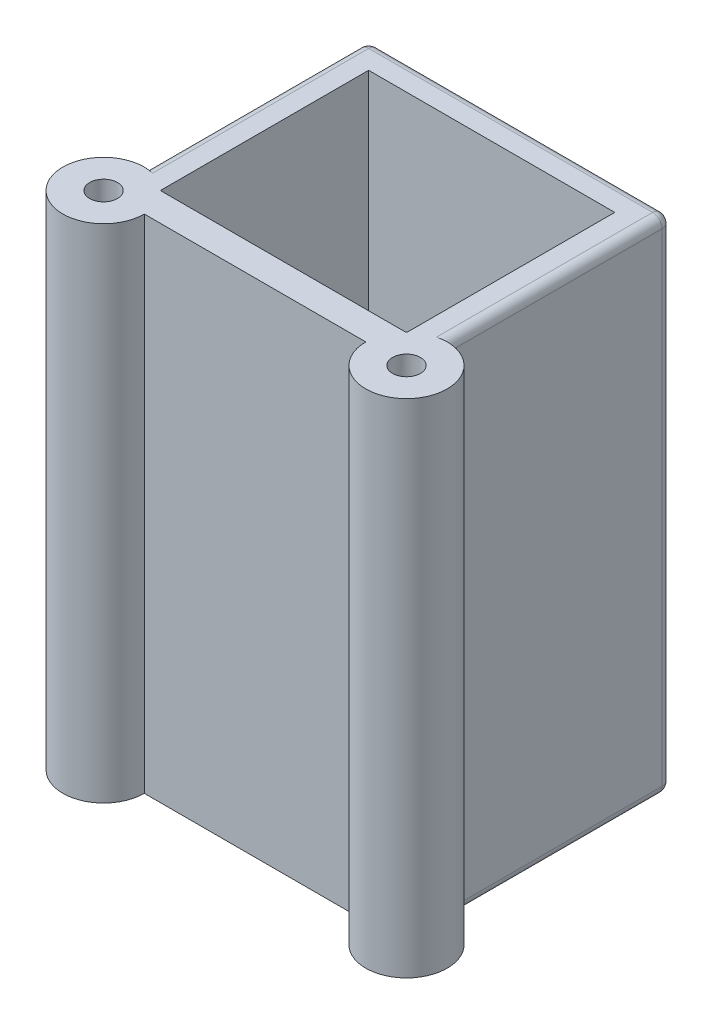
ISO-10303-21;
HEADER;
FILE_DESCRIPTION(('STEP AP214'),'2;1');
FILE_NAME('part.step','',(''),(''),'','','');
FILE_SCHEMA(('AUTOMOTIVE_DESIGN { 1 0 10303 214 1 1 1 1 }'));
ENDSEC;
DATA;
#1=APPLICATION_CONTEXT('core data for automotive mechanical design processes');
#2=APPLICATION_PROTOCOL_DEFINITION('international standard','automotive_design',2000,#1);
#3=PRODUCT_CONTEXT('',#1,'mechanical');
#4=PRODUCT('Part','Part','',(#3));
#5=PRODUCT_RELATED_PRODUCT_CATEGORY('part','',(#4));
#6=PRODUCT_DEFINITION_FORMATION('','',#4);
#7=PRODUCT_DEFINITION_CONTEXT('part definition',#1,'design');
#8=PRODUCT_DEFINITION('design','',#6,#7);
#9=PRODUCT_DEFINITION_SHAPE('','',#8);
#10=(LENGTH_UNIT() NAMED_UNIT(*) SI_UNIT(.MILLI.,.METRE.));
#11=(NAMED_UNIT(*) PLANE_ANGLE_UNIT() SI_UNIT($,.RADIAN.));
#12=(NAMED_UNIT(*) SI_UNIT($,.STERADIAN.) SOLID_ANGLE_UNIT());
#13=UNCERTAINTY_MEASURE_WITH_UNIT(LENGTH_MEASURE(1.E-05),#10,'distance_accuracy_value','');
#14=(GEOMETRIC_REPRESENTATION_CONTEXT(3) GLOBAL_UNCERTAINTY_ASSIGNED_CONTEXT((#13)) GLOBAL_UNIT_ASSIGNED_CONTEXT((#10,
#11,#12)) REPRESENTATION_CONTEXT('',''));
#15=CARTESIAN_POINT('',(0.,0.,0.));
#16=DIRECTION('',(0.,0.,1.));
#17=DIRECTION('',(1.,0.,0.));
#18=AXIS2_PLACEMENT_3D('',#15,#16,#17);
#19=CARTESIAN_POINT('',(-29.7923076923077,-3.,8.38076923076923));
#20=DIRECTION('',(-1.,0.,0.));
#21=DIRECTION('',(0.,0.,1.));
#22=AXIS2_PLACEMENT_3D('',#19,#20,#21);
#23=PLANE('',#22);
#24=DIRECTION('',(0.,0.,-1.));
#25=VECTOR('',#24,1.);
#26=CARTESIAN_POINT('',(-29.7923076923077,3.,-3.61923076923077));
#27=LINE('',#26,#25);
#28=CARTESIAN_POINT('',(-29.7923076923077,3.,-3.61923076923077));
#29=VERTEX_POINT('',#28);
#30=CARTESIAN_POINT('',(-29.7923076923077,3.,-13.6192307692308));
#31=VERTEX_POINT('',#30);
#32=EDGE_CURVE('E179',#29,#31,#27,.T.);
#33=ORIENTED_EDGE('',*,*,#32,.T.);
#34=DIRECTION('',(0.,1.,0.));
#35=VECTOR('',#34,1.);
#36=CARTESIAN_POINT('',(-29.7923076923077,-3.,-13.6192307692308));
#37=LINE('',#36,#35);
#38=CARTESIAN_POINT('',(-29.7923076923077,53.,-13.6192307692308));
#39=VERTEX_POINT('',#38);
#40=EDGE_CURVE('E245',#31,#39,#37,.T.);
#41=ORIENTED_EDGE('',*,*,#40,.T.);
#42=DIRECTION('',(0.,0.,1.));
#43=VECTOR('',#42,1.);
#44=CARTESIAN_POINT('',(-29.7923076923077,53.,8.38076923076923));
#45=LINE('',#44,#43);
#46=CARTESIAN_POINT('',(-29.7923076923077,53.,8.30018487061937));
#47=VERTEX_POINT('',#46);
#48=EDGE_CURVE('E236',#39,#47,#45,.T.);
#49=ORIENTED_EDGE('',*,*,#48,.T.);
#50=DIRECTION('',(0.,1.,0.));
#51=VECTOR('',#50,1.);
#52=CARTESIAN_POINT('',(-29.7923076923077,0.,8.30018487061937));
#53=LINE('',#52,#51);
#54=CARTESIAN_POINT('',(-29.7923076923077,0.,8.30018487061937));
#55=VERTEX_POINT('',#54);
#56=EDGE_CURVE('E227',#47,#55,#53,.F.);
#57=ORIENTED_EDGE('',*,*,#56,.T.);
#58=DIRECTION('',(0.,0.,1.));
#59=VECTOR('',#58,1.);
#60=CARTESIAN_POINT('',(-29.7923076923077,0.,0.));
#61=LINE('',#60,#59);
#62=CARTESIAN_POINT('',(-29.7923076923077,0.,-3.61923076923077));
#63=VERTEX_POINT('',#62);
#64=EDGE_CURVE('E259',#63,#55,#61,.T.);
#65=ORIENTED_EDGE('',*,*,#64,.F.);
#66=DIRECTION('',(0.,-1.,0.));
#67=VECTOR('',#66,1.);
#68=CARTESIAN_POINT('',(-29.7923076923077,0.,-3.61923076923077));
#69=LINE('',#68,#67);
#70=EDGE_CURVE('E182',#29,#63,#69,.T.);
#71=ORIENTED_EDGE('',*,*,#70,.F.);
#72=EDGE_LOOP('',(#33,#41,#49,#57,#65,#71));
#73=FACE_BOUND('',#72,.T.);
#74=ADVANCED_FACE('F33',(#73),#23,.F.);
#75=CARTESIAN_POINT('',(-29.7923076923077,-3.,-13.6192307692308));
#76=DIRECTION('',(0.,0.,-1.));
#77=DIRECTION('',(-1.,0.,0.));
#78=AXIS2_PLACEMENT_3D('',#75,#76,#77);
#79=PLANE('',#78);
#80=DIRECTION('',(-1.,0.,0.));
#81=VECTOR('',#80,1.);
#82=CARTESIAN_POINT('',(-3.7923076923077,3.,-13.6192307692308));
#83=LINE('',#82,#81);
#84=CARTESIAN_POINT('',(-3.7923076923077,3.,-13.6192307692308));
#85=VERTEX_POINT('',#84);
#86=EDGE_CURVE('E191',#85,#31,#83,.T.);
#87=ORIENTED_EDGE('',*,*,#86,.F.);
#88=DIRECTION('',(0.,1.,0.));
#89=VECTOR('',#88,1.);
#90=CARTESIAN_POINT('',(-3.7923076923077,-3.,-13.6192307692308));
#91=LINE('',#90,#89);
#92=CARTESIAN_POINT('',(-3.7923076923077,53.,-13.6192307692308));
#93=VERTEX_POINT('',#92);
#94=EDGE_CURVE('E196',#85,#93,#91,.T.);
#95=ORIENTED_EDGE('',*,*,#94,.T.);
#96=DIRECTION('',(-1.,0.,0.));
#97=VECTOR('',#96,1.);
#98=CARTESIAN_POINT('',(-29.7923076923077,53.,-13.6192307692308));
#99=LINE('',#98,#97);
#100=EDGE_CURVE('E242',#93,#39,#99,.T.);
#101=ORIENTED_EDGE('',*,*,#100,.T.);
#102=ORIENTED_EDGE('',*,*,#40,.F.);
#103=EDGE_LOOP('',(#87,#95,#101,#102));
#104=FACE_BOUND('',#103,.T.);
#105=ADVANCED_FACE('F336',(#104),#79,.F.);
#106=CARTESIAN_POINT('',(-3.7923076923077,-3.,8.38076923076923));
#107=DIRECTION('',(1.,0.,0.));
#108=DIRECTION('',(0.,0.,-1.));
#109=AXIS2_PLACEMENT_3D('',#106,#107,#108);
#110=PLANE('',#109);
#111=DIRECTION('',(0.,0.,-1.));
#112=VECTOR('',#111,1.);
#113=CARTESIAN_POINT('',(-3.7923076923077,3.,-3.61923076923077));
#114=LINE('',#113,#112);
#115=CARTESIAN_POINT('',(-3.7923076923077,3.,-3.61923076923077));
#116=VERTEX_POINT('',#115);
#117=EDGE_CURVE('E176',#116,#85,#114,.T.);
#118=ORIENTED_EDGE('',*,*,#117,.F.);
#119=DIRECTION('',(0.,1.,0.));
#120=VECTOR('',#119,1.);
#121=CARTESIAN_POINT('',(-3.7923076923077,0.,-3.61923076923077));
#122=LINE('',#121,#120);
#123=CARTESIAN_POINT('',(-3.7923076923077,0.,-3.61923076923077));
#124=VERTEX_POINT('',#123);
#125=EDGE_CURVE('E183',#124,#116,#122,.T.);
#126=ORIENTED_EDGE('',*,*,#125,.F.);
#127=DIRECTION('',(0.,0.,-1.));
#128=VECTOR('',#127,1.);
#129=CARTESIAN_POINT('',(-3.7923076923077,0.,0.));
#130=LINE('',#129,#128);
#131=CARTESIAN_POINT('',(-3.7923076923077,0.,8.30018487061936));
#132=VERTEX_POINT('',#131);
#133=EDGE_CURVE('E257',#132,#124,#130,.T.);
#134=ORIENTED_EDGE('',*,*,#133,.F.);
#135=DIRECTION('',(0.,1.,0.));
#136=VECTOR('',#135,1.);
#137=CARTESIAN_POINT('',(-3.7923076923077,0.,8.30018487061936));
#138=LINE('',#137,#136);
#139=CARTESIAN_POINT('',(-3.7923076923077,53.,8.30018487061936));
#140=VERTEX_POINT('',#139);
#141=EDGE_CURVE('E207',#132,#140,#138,.T.);
#142=ORIENTED_EDGE('',*,*,#141,.T.);
#143=DIRECTION('',(0.,0.,-1.));
#144=VECTOR('',#143,1.);
#145=CARTESIAN_POINT('',(-3.7923076923077,53.,8.38076923076923));
#146=LINE('',#145,#144);
#147=EDGE_CURVE('E240',#140,#93,#146,.T.);
#148=ORIENTED_EDGE('',*,*,#147,.T.);
#149=ORIENTED_EDGE('',*,*,#94,.F.);
#150=EDGE_LOOP('',(#118,#126,#134,#142,#148,#149));
#151=FACE_BOUND('',#150,.T.);
#152=ADVANCED_FACE('F194',(#151),#110,.F.);
#153=CARTESIAN_POINT('',(-32.7923076923077,53.,-16.6192307692308));
#154=DIRECTION('',(1.,0.,0.));
#155=DIRECTION('',(0.,0.,-1.));
#156=AXIS2_PLACEMENT_3D('',#153,#154,#155);
#157=PLANE('',#156);
#158=DIRECTION('',(0.,1.,0.));
#159=VECTOR('',#158,1.);
#160=CARTESIAN_POINT('',(-32.7923076923077,0.,7.08076923076923));
#161=LINE('',#160,#159);
#162=CARTESIAN_POINT('',(-32.7923076923077,1.,7.08076923076923));
#163=VERTEX_POINT('',#162);
#164=CARTESIAN_POINT('',(-32.7923076923077,52.,7.08076923076923));
#165=VERTEX_POINT('',#164);
#166=EDGE_CURVE('E233',#163,#165,#161,.T.);
#167=ORIENTED_EDGE('',*,*,#166,.T.);
#168=DIRECTION('',(0.,0.,1.));
#169=VECTOR('',#168,1.);
#170=CARTESIAN_POINT('',(-32.7923076923077,52.,-16.6192307692308));
#171=LINE('',#170,#169);
#172=CARTESIAN_POINT('',(-32.7923076923077,52.,-15.6192307692308));
#173=VERTEX_POINT('',#172);
#174=EDGE_CURVE('E291',#165,#173,#171,.F.);
#175=ORIENTED_EDGE('',*,*,#174,.T.);
#176=DIRECTION('',(0.,-1.,0.));
#177=VECTOR('',#176,1.);
#178=CARTESIAN_POINT('',(-32.7923076923077,53.,-15.6192307692308));
#179=LINE('',#178,#177);
#180=CARTESIAN_POINT('',(-32.7923076923077,1.,-15.6192307692308));
#181=VERTEX_POINT('',#180);
#182=EDGE_CURVE('E287',#173,#181,#179,.T.);
#183=ORIENTED_EDGE('',*,*,#182,.T.);
#184=DIRECTION('',(0.,0.,1.));
#185=VECTOR('',#184,1.);
#186=CARTESIAN_POINT('',(-32.7923076923077,1.,-16.6192307692308));
#187=LINE('',#186,#185);
#188=EDGE_CURVE('E289',#181,#163,#187,.T.);
#189=ORIENTED_EDGE('',*,*,#188,.T.);
#190=EDGE_LOOP('',(#167,#175,#183,#189));
#191=FACE_BOUND('',#190,.T.);
#192=ADVANCED_FACE('F404',(#191),#157,.F.);
#193=CARTESIAN_POINT('',(-32.7923076923077,53.,11.3807692307692));
#194=DIRECTION('',(0.,0.,-1.));
#195=DIRECTION('',(-1.,0.,0.));
#196=AXIS2_PLACEMENT_3D('',#193,#194,#195);
#197=PLANE('',#196);
#198=DIRECTION('',(1.,0.,0.));
#199=VECTOR('',#198,1.);
#200=CARTESIAN_POINT('',(-32.7923076923077,0.,11.3807692307692));
#201=LINE('',#200,#199);
#202=CARTESIAN_POINT('',(-28.4923076923077,0.,11.3807692307692));
#203=VERTEX_POINT('',#202);
#204=CARTESIAN_POINT('',(-5.0923076923077,0.,11.3807692307692));
#205=VERTEX_POINT('',#204);
#206=EDGE_CURVE('E247',#203,#205,#201,.T.);
#207=ORIENTED_EDGE('',*,*,#206,.T.);
#208=DIRECTION('',(0.,1.,0.));
#209=VECTOR('',#208,1.);
#210=CARTESIAN_POINT('',(-5.0923076923077,0.,11.3807692307692));
#211=LINE('',#210,#209);
#212=CARTESIAN_POINT('',(-5.0923076923077,53.,11.3807692307692));
#213=VERTEX_POINT('',#212);
#214=EDGE_CURVE('E212',#205,#213,#211,.T.);
#215=ORIENTED_EDGE('',*,*,#214,.T.);
#216=DIRECTION('',(1.,0.,0.));
#217=VECTOR('',#216,1.);
#218=CARTESIAN_POINT('',(-32.7923076923077,53.,11.3807692307692));
#219=LINE('',#218,#217);
#220=CARTESIAN_POINT('',(-28.4923076923077,53.,11.3807692307692));
#221=VERTEX_POINT('',#220);
#222=EDGE_CURVE('E249',#221,#213,#219,.T.);
#223=ORIENTED_EDGE('',*,*,#222,.F.);
#224=DIRECTION('',(0.,1.,0.));
#225=VECTOR('',#224,1.);
#226=CARTESIAN_POINT('',(-28.4923076923077,0.,11.3807692307692));
#227=LINE('',#226,#225);
#228=EDGE_CURVE('E230',#221,#203,#227,.F.);
#229=ORIENTED_EDGE('',*,*,#228,.T.);
#230=EDGE_LOOP('',(#207,#215,#223,#229));
#231=FACE_BOUND('',#230,.T.);
#232=ADVANCED_FACE('F401',(#231),#197,.F.);
#233=CARTESIAN_POINT('',(-0.792307692307696,53.,-16.6192307692308));
#234=DIRECTION('',(-1.,0.,0.));
#235=DIRECTION('',(0.,0.,1.));
#236=AXIS2_PLACEMENT_3D('',#233,#234,#235);
#237=PLANE('',#236);
#238=DIRECTION('',(0.,1.,0.));
#239=VECTOR('',#238,1.);
#240=CARTESIAN_POINT('',(-0.792307692307696,0.,7.08076923076923));
#241=LINE('',#240,#239);
#242=CARTESIAN_POINT('',(-0.792307692307696,52.,7.08076923076923));
#243=VERTEX_POINT('',#242);
#244=CARTESIAN_POINT('',(-0.792307692307696,1.,7.08076923076923));
#245=VERTEX_POINT('',#244);
#246=EDGE_CURVE('E209',#243,#245,#241,.F.);
#247=ORIENTED_EDGE('',*,*,#246,.T.);
#248=DIRECTION('',(0.,0.,-1.));
#249=VECTOR('',#248,1.);
#250=CARTESIAN_POINT('',(-0.792307692307696,1.,-16.6192307692308));
#251=LINE('',#250,#249);
#252=CARTESIAN_POINT('',(-0.792307692307696,1.,-15.6192307692308));
#253=VERTEX_POINT('',#252);
#254=EDGE_CURVE('E270',#245,#253,#251,.T.);
#255=ORIENTED_EDGE('',*,*,#254,.T.);
#256=DIRECTION('',(0.,-1.,0.));
#257=VECTOR('',#256,1.);
#258=CARTESIAN_POINT('',(-0.792307692307696,53.,-15.6192307692308));
#259=LINE('',#258,#257);
#260=CARTESIAN_POINT('',(-0.792307692307696,52.,-15.6192307692308));
#261=VERTEX_POINT('',#260);
#262=EDGE_CURVE('E266',#253,#261,#259,.F.);
#263=ORIENTED_EDGE('',*,*,#262,.T.);
#264=DIRECTION('',(0.,0.,-1.));
#265=VECTOR('',#264,1.);
#266=CARTESIAN_POINT('',(-0.792307692307696,52.,7.08076923076923));
#267=LINE('',#266,#265);
#268=EDGE_CURVE('E268',#261,#243,#267,.F.);
#269=ORIENTED_EDGE('',*,*,#268,.T.);
#270=EDGE_LOOP('',(#247,#255,#263,#269));
#271=FACE_BOUND('',#270,.T.);
#272=ADVANCED_FACE('F398',(#271),#237,.F.);
#273=CARTESIAN_POINT('',(-32.7923076923077,53.,-16.6192307692308));
#274=DIRECTION('',(0.,0.,1.));
#275=DIRECTION('',(1.,0.,0.));
#276=AXIS2_PLACEMENT_3D('',#273,#274,#275);
#277=PLANE('',#276);
#278=DIRECTION('',(0.,-1.,0.));
#279=VECTOR('',#278,1.);
#280=CARTESIAN_POINT('',(-31.7923076923077,53.,-16.6192307692308));
#281=LINE('',#280,#279);
#282=CARTESIAN_POINT('',(-31.7923076923077,1.,-16.6192307692308));
#283=VERTEX_POINT('',#282);
#284=CARTESIAN_POINT('',(-31.7923076923077,52.,-16.6192307692308));
#285=VERTEX_POINT('',#284);
#286=EDGE_CURVE('E293',#283,#285,#281,.F.);
#287=ORIENTED_EDGE('',*,*,#286,.T.);
#288=DIRECTION('',(-1.,0.,0.));
#289=VECTOR('',#288,1.);
#290=CARTESIAN_POINT('',(-0.792307692307696,52.,-16.6192307692308));
#291=LINE('',#290,#289);
#292=CARTESIAN_POINT('',(-1.7923076923077,52.,-16.6192307692308));
#293=VERTEX_POINT('',#292);
#294=EDGE_CURVE('E298',#285,#293,#291,.F.);
#295=ORIENTED_EDGE('',*,*,#294,.T.);
#296=DIRECTION('',(0.,-1.,0.));
#297=VECTOR('',#296,1.);
#298=CARTESIAN_POINT('',(-1.7923076923077,53.,-16.6192307692308));
#299=LINE('',#298,#297);
#300=CARTESIAN_POINT('',(-1.7923076923077,1.,-16.6192307692308));
#301=VERTEX_POINT('',#300);
#302=EDGE_CURVE('E51',#293,#301,#299,.T.);
#303=ORIENTED_EDGE('',*,*,#302,.T.);
#304=DIRECTION('',(-1.,0.,0.));
#305=VECTOR('',#304,1.);
#306=CARTESIAN_POINT('',(-32.7923076923077,1.,-16.6192307692308));
#307=LINE('',#306,#305);
#308=EDGE_CURVE('E295',#301,#283,#307,.T.);
#309=ORIENTED_EDGE('',*,*,#308,.T.);
#310=EDGE_LOOP('',(#287,#295,#303,#309));
#311=FACE_BOUND('',#310,.T.);
#312=ADVANCED_FACE('F391',(#311),#277,.F.);
#313=CARTESIAN_POINT('',(0.,53.,0.));
#314=DIRECTION('',(0.,1.,0.));
#315=DIRECTION('',(0.,0.,1.));
#316=AXIS2_PLACEMENT_3D('',#313,#314,#315);
#317=PLANE('',#316);
#318=CARTESIAN_POINT('',(-0.792307692307696,53.,11.3807692307692));
#319=DIRECTION('',(0.,1.,0.));
#320=DIRECTION('',(0.,0.,1.));
#321=AXIS2_PLACEMENT_3D('',#318,#319,#320);
#322=CIRCLE('',#321,4.3);
#323=CARTESIAN_POINT('',(-1.7923076923077,53.,7.19866449750393));
#324=VERTEX_POINT('',#323);
#325=EDGE_CURVE('E197',#213,#324,#322,.T.);
#326=ORIENTED_EDGE('',*,*,#325,.T.);
#327=DIRECTION('',(0.,0.,-1.));
#328=VECTOR('',#327,1.);
#329=CARTESIAN_POINT('',(-1.7923076923077,53.,-16.6192307692308));
#330=LINE('',#329,#328);
#331=CARTESIAN_POINT('',(-1.7923076923077,53.,-15.6192307692308));
#332=VERTEX_POINT('',#331);
#333=EDGE_CURVE('E285',#324,#332,#330,.T.);
#334=ORIENTED_EDGE('',*,*,#333,.T.);
#335=DIRECTION('',(-1.,0.,0.));
#336=VECTOR('',#335,1.);
#337=CARTESIAN_POINT('',(-32.7923076923077,53.,-15.6192307692308));
#338=LINE('',#337,#336);
#339=CARTESIAN_POINT('',(-31.7923076923077,53.,-15.6192307692308));
#340=VERTEX_POINT('',#339);
#341=EDGE_CURVE('E280',#332,#340,#338,.T.);
#342=ORIENTED_EDGE('',*,*,#341,.T.);
#343=DIRECTION('',(0.,0.,1.));
#344=VECTOR('',#343,1.);
#345=CARTESIAN_POINT('',(-31.7923076923077,53.,7.08076923076923));
#346=LINE('',#345,#344);
#347=CARTESIAN_POINT('',(-31.7923076923077,53.,7.19866449750394));
#348=VERTEX_POINT('',#347);
#349=EDGE_CURVE('E282',#340,#348,#346,.T.);
#350=ORIENTED_EDGE('',*,*,#349,.T.);
#351=CARTESIAN_POINT('',(-32.7923076923077,53.,11.3807692307692));
#352=DIRECTION('',(0.,1.,0.));
#353=DIRECTION('',(0.,0.,1.));
#354=AXIS2_PLACEMENT_3D('',#351,#352,#353);
#355=CIRCLE('',#354,4.3);
#356=EDGE_CURVE('E219',#348,#221,#355,.T.);
#357=ORIENTED_EDGE('',*,*,#356,.T.);
#358=ORIENTED_EDGE('',*,*,#222,.T.);
#359=EDGE_LOOP('',(#326,#334,#342,#350,#357,#358));
#360=FACE_BOUND('',#359,.T.);
#361=CARTESIAN_POINT('',(-0.792307692307696,53.,11.3807692307692));
#362=DIRECTION('',(0.,1.,0.));
#363=DIRECTION('',(0.,0.,1.));
#364=AXIS2_PLACEMENT_3D('',#361,#362,#363);
#365=CIRCLE('',#364,1.47);
#366=CARTESIAN_POINT('',(-0.792307692307696,53.,12.8507692307692));
#367=VERTEX_POINT('',#366);
#368=EDGE_CURVE('E421',#367,#367,#365,.T.);
#369=ORIENTED_EDGE('',*,*,#368,.F.);
#370=EDGE_LOOP('',(#369));
#371=FACE_BOUND('',#370,.T.);
#372=ORIENTED_EDGE('',*,*,#147,.F.);
#373=CARTESIAN_POINT('',(-3.87289205245757,53.,8.38076923076923));
#374=VERTEX_POINT('',#373);
#375=EDGE_CURVE('E199',#140,#374,#322,.T.);
#376=ORIENTED_EDGE('',*,*,#375,.T.);
#377=DIRECTION('',(1.,0.,0.));
#378=VECTOR('',#377,1.);
#379=CARTESIAN_POINT('',(-29.7923076923077,53.,8.38076923076923));
#380=LINE('',#379,#378);
#381=CARTESIAN_POINT('',(-29.7117233321578,53.,8.38076923076923));
#382=VERTEX_POINT('',#381);
#383=EDGE_CURVE('E238',#382,#374,#380,.T.);
#384=ORIENTED_EDGE('',*,*,#383,.F.);
#385=EDGE_CURVE('E225',#382,#47,#355,.T.);
#386=ORIENTED_EDGE('',*,*,#385,.T.);
#387=ORIENTED_EDGE('',*,*,#48,.F.);
#388=ORIENTED_EDGE('',*,*,#100,.F.);
#389=EDGE_LOOP('',(#372,#376,#384,#386,#387,#388));
#390=FACE_BOUND('',#389,.T.);
#391=CARTESIAN_POINT('',(-32.7923076923077,53.,11.3807692307692));
#392=DIRECTION('',(0.,1.,0.));
#393=DIRECTION('',(0.,0.,1.));
#394=AXIS2_PLACEMENT_3D('',#391,#392,#393);
#395=CIRCLE('',#394,1.47);
#396=CARTESIAN_POINT('',(-32.7923076923077,53.,12.8507692307692));
#397=VERTEX_POINT('',#396);
#398=EDGE_CURVE('E215',#397,#397,#395,.T.);
#399=ORIENTED_EDGE('',*,*,#398,.F.);
#400=EDGE_LOOP('',(#399));
#401=FACE_BOUND('',#400,.T.);
#402=ADVANCED_FACE('F387',(#360,#371,#390,#401),#317,.T.);
#403=CARTESIAN_POINT('',(0.,0.,0.));
#404=DIRECTION('',(0.,1.,0.));
#405=DIRECTION('',(0.,0.,1.));
#406=AXIS2_PLACEMENT_3D('',#403,#404,#405);
#407=PLANE('',#406);
#408=CARTESIAN_POINT('',(-0.792307692307696,0.,11.3807692307692));
#409=DIRECTION('',(0.,1.,0.));
#410=DIRECTION('',(0.,0.,1.));
#411=AXIS2_PLACEMENT_3D('',#408,#409,#410);
#412=CIRCLE('',#411,1.47);
#413=CARTESIAN_POINT('',(-0.792307692307696,0.,12.8507692307692));
#414=VERTEX_POINT('',#413);
#415=EDGE_CURVE('E714',#414,#414,#412,.T.);
#416=ORIENTED_EDGE('',*,*,#415,.T.);
#417=EDGE_LOOP('',(#416));
#418=FACE_BOUND('',#417,.T.);
#419=DIRECTION('',(1.,0.,0.));
#420=VECTOR('',#419,1.);
#421=CARTESIAN_POINT('',(-3.7923076923077,0.,-3.61923076923077));
#422=LINE('',#421,#420);
#423=EDGE_CURVE('E188',#63,#124,#422,.T.);
#424=ORIENTED_EDGE('',*,*,#423,.F.);
#425=ORIENTED_EDGE('',*,*,#64,.T.);
#426=CARTESIAN_POINT('',(-32.7923076923077,0.,11.3807692307692));
#427=DIRECTION('',(0.,1.,0.));
#428=DIRECTION('',(0.,0.,1.));
#429=AXIS2_PLACEMENT_3D('',#426,#427,#428);
#430=CIRCLE('',#429,4.3);
#431=CARTESIAN_POINT('',(-29.7117233321578,0.,8.38076923076923));
#432=VERTEX_POINT('',#431);
#433=EDGE_CURVE('E224',#432,#55,#430,.T.);
#434=ORIENTED_EDGE('',*,*,#433,.F.);
#435=DIRECTION('',(1.,0.,0.));
#436=VECTOR('',#435,1.);
#437=CARTESIAN_POINT('',(0.,0.,8.38076923076923));
#438=LINE('',#437,#436);
#439=CARTESIAN_POINT('',(-3.87289205245757,0.,8.38076923076923));
#440=VERTEX_POINT('',#439);
#441=EDGE_CURVE('E252',#432,#440,#438,.T.);
#442=ORIENTED_EDGE('',*,*,#441,.T.);
#443=CARTESIAN_POINT('',(-0.792307692307696,0.,11.3807692307692));
#444=DIRECTION('',(0.,1.,0.));
#445=DIRECTION('',(0.,0.,1.));
#446=AXIS2_PLACEMENT_3D('',#443,#444,#445);
#447=CIRCLE('',#446,4.3);
#448=EDGE_CURVE('E205',#132,#440,#447,.T.);
#449=ORIENTED_EDGE('',*,*,#448,.F.);
#450=ORIENTED_EDGE('',*,*,#133,.T.);
#451=EDGE_LOOP('',(#424,#425,#434,#442,#449,#450));
#452=FACE_BOUND('',#451,.T.);
#453=CARTESIAN_POINT('',(-32.7923076923077,0.,11.3807692307692));
#454=DIRECTION('',(0.,1.,0.));
#455=DIRECTION('',(0.,0.,1.));
#456=AXIS2_PLACEMENT_3D('',#453,#454,#455);
#457=CIRCLE('',#456,1.47);
#458=CARTESIAN_POINT('',(-32.7923076923077,0.,12.8507692307692));
#459=VERTEX_POINT('',#458);
#460=EDGE_CURVE('E216',#459,#459,#457,.T.);
#461=ORIENTED_EDGE('',*,*,#460,.T.);
#462=EDGE_LOOP('',(#461));
#463=FACE_BOUND('',#462,.T.);
#464=DIRECTION('',(0.,0.,-1.));
#465=VECTOR('',#464,1.);
#466=CARTESIAN_POINT('',(-1.7923076923077,0.,0.));
#467=LINE('',#466,#465);
#468=CARTESIAN_POINT('',(-1.7923076923077,0.,-15.6192307692308));
#469=VERTEX_POINT('',#468);
#470=CARTESIAN_POINT('',(-1.7923076923077,0.,7.19866449750393));
#471=VERTEX_POINT('',#470);
#472=EDGE_CURVE('E277',#469,#471,#467,.F.);
#473=ORIENTED_EDGE('',*,*,#472,.T.);
#474=EDGE_CURVE('E204',#205,#471,#447,.T.);
#475=ORIENTED_EDGE('',*,*,#474,.F.);
#476=ORIENTED_EDGE('',*,*,#206,.F.);
#477=CARTESIAN_POINT('',(-31.7923076923077,0.,7.19866449750394));
#478=VERTEX_POINT('',#477);
#479=EDGE_CURVE('E222',#478,#203,#430,.T.);
#480=ORIENTED_EDGE('',*,*,#479,.F.);
#481=DIRECTION('',(0.,0.,1.));
#482=VECTOR('',#481,1.);
#483=CARTESIAN_POINT('',(-31.7923076923077,0.,0.));
#484=LINE('',#483,#482);
#485=CARTESIAN_POINT('',(-31.7923076923077,0.,-15.6192307692308));
#486=VERTEX_POINT('',#485);
#487=EDGE_CURVE('E273',#478,#486,#484,.F.);
#488=ORIENTED_EDGE('',*,*,#487,.T.);
#489=DIRECTION('',(-1.,0.,0.));
#490=VECTOR('',#489,1.);
#491=CARTESIAN_POINT('',(0.,0.,-15.6192307692308));
#492=LINE('',#491,#490);
#493=EDGE_CURVE('E275',#486,#469,#492,.F.);
#494=ORIENTED_EDGE('',*,*,#493,.T.);
#495=EDGE_LOOP('',(#473,#475,#476,#480,#488,#494));
#496=FACE_BOUND('',#495,.T.);
#497=ADVANCED_FACE('F390',(#418,#452,#463,#496),#407,.F.);
#498=CARTESIAN_POINT('',(-29.7923076923077,-3.,8.38076923076923));
#499=DIRECTION('',(0.,0.,1.));
#500=DIRECTION('',(1.,0.,0.));
#501=AXIS2_PLACEMENT_3D('',#498,#499,#500);
#502=PLANE('',#501);
#503=ORIENTED_EDGE('',*,*,#383,.T.);
#504=DIRECTION('',(0.,1.,0.));
#505=VECTOR('',#504,1.);
#506=CARTESIAN_POINT('',(-3.87289205245757,0.,8.38076923076923));
#507=LINE('',#506,#505);
#508=EDGE_CURVE('E264',#374,#440,#507,.F.);
#509=ORIENTED_EDGE('',*,*,#508,.T.);
#510=ORIENTED_EDGE('',*,*,#441,.F.);
#511=DIRECTION('',(0.,1.,0.));
#512=VECTOR('',#511,1.);
#513=CARTESIAN_POINT('',(-29.7117233321578,0.,8.38076923076923));
#514=LINE('',#513,#512);
#515=EDGE_CURVE('E261',#432,#382,#514,.T.);
#516=ORIENTED_EDGE('',*,*,#515,.T.);
#517=EDGE_LOOP('',(#503,#509,#510,#516));
#518=FACE_BOUND('',#517,.T.);
#519=ADVANCED_FACE('F386',(#518),#502,.F.);
#520=CARTESIAN_POINT('',(-32.7923076923077,0.,11.3807692307692));
#521=DIRECTION('',(0.,1.,0.));
#522=DIRECTION('',(0.,0.,1.));
#523=AXIS2_PLACEMENT_3D('',#520,#521,#522);
#524=CYLINDRICAL_SURFACE('',#523,4.3);
#525=ORIENTED_EDGE('',*,*,#56,.F.);
#526=ORIENTED_EDGE('',*,*,#385,.F.);
#527=ORIENTED_EDGE('',*,*,#515,.F.);
#528=ORIENTED_EDGE('',*,*,#433,.T.);
#529=EDGE_LOOP('',(#525,#526,#527,#528));
#530=FACE_BOUND('',#529,.T.);
#531=ADVANCED_FACE('F334',(#530),#524,.T.);
#532=ORIENTED_EDGE('',*,*,#166,.F.);
#533=CARTESIAN_POINT('',(-32.7923076923077,1.,7.08076923076923));
#534=CARTESIAN_POINT('',(-32.7923075032862,0.971880307603241,7.08077081800397));
#535=CARTESIAN_POINT('',(-32.7911208727407,0.943774082411281,7.08076905224123));
#536=CARTESIAN_POINT('',(-32.7863868998328,0.887762479586267,7.0807723463136));
#537=CARTESIAN_POINT('',(-32.7828396653318,0.859857092835328,7.08077740583686));
#538=CARTESIAN_POINT('',(-32.7686898305053,0.776785373269519,7.08082306931708));
#539=CARTESIAN_POINT('',(-32.7545790115582,0.722174967020772,7.08089407906793));
#540=CARTESIAN_POINT('',(-32.7173933797475,0.616097343848289,7.08138211458578));
#541=CARTESIAN_POINT('',(-32.6943139985568,0.564631744284104,7.08179931681641));
#542=CARTESIAN_POINT('',(-32.6398526481634,0.466311816656616,7.08338669553418));
#543=CARTESIAN_POINT('',(-32.6084720788485,0.419456712919103,7.08455674511099));
#544=CARTESIAN_POINT('',(-32.5384006988455,0.331803181542372,7.08812955601128));
#545=CARTESIAN_POINT('',(-32.4997265938127,0.29099128612852,7.09052952140478));
#546=CARTESIAN_POINT('',(-32.4161745582192,0.21646785830312,7.09704712103148));
#547=CARTESIAN_POINT('',(-32.3712968071967,0.182756120478997,7.10116470556245));
#548=CARTESIAN_POINT('',(-32.2771628122955,0.123657245505873,7.11147835252704));
#549=CARTESIAN_POINT('',(-32.2279507875442,0.0981961703695445,7.11765488711454));
#550=CARTESIAN_POINT('',(-32.1263011855118,0.0558191267060331,7.1323498765355));
#551=CARTESIAN_POINT('',(-32.0738643094727,0.0389013077708267,7.14086782361802));
#552=CARTESIAN_POINT('',(-31.9829977668333,0.0175871901491003,7.1574431571915));
#553=CARTESIAN_POINT('',(-31.9449609946446,0.0109751904645311,7.16490549025823));
#554=CARTESIAN_POINT('',(-31.8686781327852,0.00218105116645089,7.18095456469262));
#555=CARTESIAN_POINT('',(-31.8304324859558,-8.29940516079052E-06,7.18953945140153));
#556=CARTESIAN_POINT('',(-31.7923076923077,0.,7.19866449750393));
#557=B_SPLINE_CURVE_WITH_KNOTS('',3,(#533,#534,#535,#536,#537,#538,#539,#540,#541,#542,#543,
#544,#545,#546,#547,#548,#549,#550,#551,#552,#553,#554,#555,#556),.UNSPECIFIED.,.F.,.F.,(4,2,2,
2,2,2,2,2,2,2,2,4),(0.,0.0843072961978364,0.168610740465532,0.336955462932782,0.505386047988147,
0.673788247496804,0.841809310485981,1.00982551183917,1.1762914924669,1.34272140227599,
1.46043363860093,1.5779537942701),.UNSPECIFIED.);
#558=EDGE_CURVE('E11',#163,#478,#557,.T.);
#559=ORIENTED_EDGE('',*,*,#558,.T.);
#560=ORIENTED_EDGE('',*,*,#479,.T.);
#561=ORIENTED_EDGE('',*,*,#228,.F.);
#562=ORIENTED_EDGE('',*,*,#356,.F.);
#563=CARTESIAN_POINT('',(-31.7923076923077,53.,7.19866449750394));
#564=CARTESIAN_POINT('',(-31.8196007372661,52.9999998251258,7.19213692878313));
#565=CARTESIAN_POINT('',(-31.8469474377057,52.9988817624269,7.1858821985335));
#566=CARTESIAN_POINT('',(-31.9015830276547,52.9943898815311,7.17394261822015));
#567=CARTESIAN_POINT('',(-31.9288719096689,52.9910157869141,7.16825783808765));
#568=CARTESIAN_POINT('',(-32.0103243782953,52.9774914452862,7.15211084238413));
#569=CARTESIAN_POINT('',(-32.0641445839773,52.9639392342878,7.14253911970974));
#570=CARTESIAN_POINT('',(-32.1691755573858,52.9279334236624,7.12582554214712));
#571=CARTESIAN_POINT('',(-32.2203827864431,52.9054680964152,7.11868691174999));
#572=CARTESIAN_POINT('',(-32.3185177946379,52.852183679882,7.10666501366363));
#573=CARTESIAN_POINT('',(-32.3654475126307,52.8213684007722,7.10178072003669));
#574=CARTESIAN_POINT('',(-32.4529678595504,52.7527148743812,7.09395726647682));
#575=CARTESIAN_POINT('',(-32.4936375282035,52.7149801902842,7.09099201515166));
#576=CARTESIAN_POINT('',(-32.5682277649541,52.633252989758,7.08644880338746));
#577=CARTESIAN_POINT('',(-32.6021463072399,52.589258601749,7.08487125887371));
#578=CARTESIAN_POINT('',(-32.6624240961977,52.49598388412,7.08262442392628));
#579=CARTESIAN_POINT('',(-32.6887380343219,52.4466741817874,7.08196049213426));
#580=CARTESIAN_POINT('',(-32.7327902557629,52.3443700522857,7.08112446905847));
#581=CARTESIAN_POINT('',(-32.7505324310358,52.2913773099038,7.08095215438432));
#582=CARTESIAN_POINT('',(-32.7732272443039,52.1984841503755,7.08080089824878));
#583=CARTESIAN_POINT('',(-32.7803754943508,52.1591052364933,7.08078113245037));
#584=CARTESIAN_POINT('',(-32.7899169718861,52.0798226213506,7.08076925383524));
#585=CARTESIAN_POINT('',(-32.7923157691598,52.0399195901062,7.08077710859723));
#586=CARTESIAN_POINT('',(-32.7923076923077,52.,7.08076923076923));
#587=B_SPLINE_CURVE_WITH_KNOTS('',3,(#563,#564,#565,#566,#567,#568,#569,#570,#571,#572,#573,
#574,#575,#576,#577,#578,#579,#580,#581,#582,#583,#584,#585,#586),.UNSPECIFIED.,.F.,.F.,(4,2,2,
2,2,2,2,2,2,2,2,4),(0.,0.0841410005239728,0.16829231230388,0.336379339080393,0.504688267285451,
0.67292052320577,0.838814561994357,1.00475830583564,1.17167127480669,1.33850838658488,
1.45830394860465,1.57795894038564),.UNSPECIFIED.);
#588=EDGE_CURVE('E43',#348,#165,#587,.T.);
#589=ORIENTED_EDGE('',*,*,#588,.T.);
#590=EDGE_LOOP('',(#532,#559,#560,#561,#562,#589));
#591=FACE_BOUND('',#590,.T.);
#592=ADVANCED_FACE('F329',(#591),#524,.T.);
#593=CARTESIAN_POINT('',(-32.7923076923077,0.,11.3807692307692));
#594=DIRECTION('',(0.,1.,0.));
#595=DIRECTION('',(0.,0.,1.));
#596=AXIS2_PLACEMENT_3D('',#593,#594,#595);
#597=CYLINDRICAL_SURFACE('',#596,1.47);
#598=ORIENTED_EDGE('',*,*,#460,.F.);
#599=EDGE_LOOP('',(#598));
#600=FACE_BOUND('',#599,.T.);
#601=ORIENTED_EDGE('',*,*,#398,.T.);
#602=EDGE_LOOP('',(#601));
#603=FACE_BOUND('',#602,.T.);
#604=ADVANCED_FACE('F325',(#600,#603),#597,.F.);
#605=CARTESIAN_POINT('',(-0.792307692307696,0.,11.3807692307692));
#606=DIRECTION('',(0.,1.,0.));
#607=DIRECTION('',(0.,0.,1.));
#608=AXIS2_PLACEMENT_3D('',#605,#606,#607);
#609=CYLINDRICAL_SURFACE('',#608,4.3);
#610=ORIENTED_EDGE('',*,*,#141,.F.);
#611=ORIENTED_EDGE('',*,*,#448,.T.);
#612=ORIENTED_EDGE('',*,*,#508,.F.);
#613=ORIENTED_EDGE('',*,*,#375,.F.);
#614=EDGE_LOOP('',(#610,#611,#612,#613));
#615=FACE_BOUND('',#614,.T.);
#616=ADVANCED_FACE('F322',(#615),#609,.T.);
#617=ORIENTED_EDGE('',*,*,#214,.F.);
#618=ORIENTED_EDGE('',*,*,#474,.T.);
#619=CARTESIAN_POINT('',(-1.7923076923077,0.,7.19866449750393));
#620=CARTESIAN_POINT('',(-1.7650146473493,1.74874210809934E-07,7.19213692878312));
#621=CARTESIAN_POINT('',(-1.73766794690973,0.00111823757307298,7.1858821985335));
#622=CARTESIAN_POINT('',(-1.68303235696071,0.00561011846890836,7.17394261822014));
#623=CARTESIAN_POINT('',(-1.65574347494651,0.00898421308593026,7.16825783808765));
#624=CARTESIAN_POINT('',(-1.57429100632011,0.0225085547137874,7.15211084238413));
#625=CARTESIAN_POINT('',(-1.5204708006381,0.0360607657121645,7.14253911970974));
#626=CARTESIAN_POINT('',(-1.41543982722964,0.0720665763376135,7.12582554214712));
#627=CARTESIAN_POINT('',(-1.36423259817229,0.0945319035848293,7.11868691174999));
#628=CARTESIAN_POINT('',(-1.26609758997745,0.147816320118052,7.10666501366363));
#629=CARTESIAN_POINT('',(-1.2191678719847,0.178631599227795,7.10178072003669));
#630=CARTESIAN_POINT('',(-1.13164752506495,0.247285125618844,7.09395726647682));
#631=CARTESIAN_POINT('',(-1.09097785641187,0.285019809715786,7.09099201515166));
#632=CARTESIAN_POINT('',(-1.01638761966135,0.366747010242002,7.08644880338746));
#633=CARTESIAN_POINT('',(-0.982469077375542,0.410741398250996,7.08487125887371));
#634=CARTESIAN_POINT('',(-0.922191288417718,0.504016115879961,7.08262442392628));
#635=CARTESIAN_POINT('',(-0.895877350293552,0.553325818212636,7.08196049213426));
#636=CARTESIAN_POINT('',(-0.851825128852491,0.655629947714329,7.08112446905847));
#637=CARTESIAN_POINT('',(-0.834082953579606,0.708622690096162,7.08095215438432));
#638=CARTESIAN_POINT('',(-0.81138814031152,0.801515849624489,7.08080089824878));
#639=CARTESIAN_POINT('',(-0.804239890264597,0.840894763506703,7.08078113245037));
#640=CARTESIAN_POINT('',(-0.794698412729308,0.920177378649367,7.08076925383524));
#641=CARTESIAN_POINT('',(-0.792299615455563,0.960080409893803,7.08077710859723));
#642=CARTESIAN_POINT('',(-0.792307692307696,1.,7.08076923076923));
#643=B_SPLINE_CURVE_WITH_KNOTS('',3,(#619,#620,#621,#622,#623,#624,#625,#626,#627,#628,#629,
#630,#631,#632,#633,#634,#635,#636,#637,#638,#639,#640,#641,#642),.UNSPECIFIED.,.F.,.F.,(4,2,2,
2,2,2,2,2,2,2,2,4),(0.,0.0841410005239761,0.168292312303886,0.336379339080392,0.50468826728545,
0.672920523205772,0.838814561994359,1.00475830583563,1.17167127480668,1.33850838658488,
1.45830394860465,1.57795894038563),.UNSPECIFIED.);
#644=EDGE_CURVE('E300',#471,#245,#643,.T.);
#645=ORIENTED_EDGE('',*,*,#644,.T.);
#646=ORIENTED_EDGE('',*,*,#246,.F.);
#647=CARTESIAN_POINT('',(-0.792307692307696,52.,7.08076923076923));
#648=CARTESIAN_POINT('',(-0.792307881329161,52.0281196923968,7.08077081800397));
#649=CARTESIAN_POINT('',(-0.79349451187468,52.0562259175887,7.08076905224123));
#650=CARTESIAN_POINT('',(-0.798228484782636,52.1122375204137,7.0807723463136));
#651=CARTESIAN_POINT('',(-0.801775719283638,52.1401429071647,7.08077740583685));
#652=CARTESIAN_POINT('',(-0.81592555411011,52.2232146267305,7.08082306931708));
#653=CARTESIAN_POINT('',(-0.830036373057153,52.2778250329792,7.08089407906793));
#654=CARTESIAN_POINT('',(-0.867222004867861,52.3839026561517,7.08138211458578));
#655=CARTESIAN_POINT('',(-0.890301386058623,52.4353682557159,7.08179931681641));
#656=CARTESIAN_POINT('',(-0.944762736452018,52.5336881833434,7.08338669553418));
#657=CARTESIAN_POINT('',(-0.976143305766935,52.5805432870809,7.08455674511099));
#658=CARTESIAN_POINT('',(-1.04621468576986,52.6681968184576,7.08812955601128));
#659=CARTESIAN_POINT('',(-1.08488879080269,52.7090087138715,7.09052952140478));
#660=CARTESIAN_POINT('',(-1.16844082639617,52.7835321416969,7.09704712103147));
#661=CARTESIAN_POINT('',(-1.21331857741872,52.817243879521,7.10116470556245));
#662=CARTESIAN_POINT('',(-1.30745257231992,52.8763427544941,7.11147835252704));
#663=CARTESIAN_POINT('',(-1.35666459707115,52.9018038296305,7.11765488711454));
#664=CARTESIAN_POINT('',(-1.45831419910361,52.944180873294,7.1323498765355));
#665=CARTESIAN_POINT('',(-1.51075107514269,52.9610986922292,7.14086782361802));
#666=CARTESIAN_POINT('',(-1.60161761778206,52.9824128098509,7.1574431571915));
#667=CARTESIAN_POINT('',(-1.63965438997078,52.9890248095355,7.16490549025823));
#668=CARTESIAN_POINT('',(-1.71593725183023,52.9978189488336,7.18095456469262));
#669=CARTESIAN_POINT('',(-1.75418289865962,53.0000082994052,7.18953945140154));
#670=CARTESIAN_POINT('',(-1.7923076923077,53.,7.19866449750393));
#671=B_SPLINE_CURVE_WITH_KNOTS('',3,(#647,#648,#649,#650,#651,#652,#653,#654,#655,#656,#657,
#658,#659,#660,#661,#662,#663,#664,#665,#666,#667,#668,#669,#670),.UNSPECIFIED.,.F.,.F.,(4,2,2,
2,2,2,2,2,2,2,2,4),(0.,0.0843072961978418,0.168610740465534,0.33695546293278,0.505386047988147,
0.673788247496797,0.841809310485969,1.00982551183917,1.1762914924669,1.34272140227599,
1.46043363860094,1.57795379427011),.UNSPECIFIED.);
#672=EDGE_CURVE('E307',#243,#324,#671,.T.);
#673=ORIENTED_EDGE('',*,*,#672,.T.);
#674=ORIENTED_EDGE('',*,*,#325,.F.);
#675=EDGE_LOOP('',(#617,#618,#645,#646,#673,#674));
#676=FACE_BOUND('',#675,.T.);
#677=ADVANCED_FACE('F317',(#676),#609,.T.);
#678=CARTESIAN_POINT('',(-3.7923076923077,3.,-3.61923076923077));
#679=DIRECTION('',(0.,-1.,0.));
#680=DIRECTION('',(1.,0.,0.));
#681=AXIS2_PLACEMENT_3D('',#678,#679,#680);
#682=PLANE('',#681);
#683=ORIENTED_EDGE('',*,*,#86,.T.);
#684=ORIENTED_EDGE('',*,*,#32,.F.);
#685=DIRECTION('',(-1.,0.,0.));
#686=VECTOR('',#685,1.);
#687=CARTESIAN_POINT('',(-3.7923076923077,3.,-3.61923076923077));
#688=LINE('',#687,#686);
#689=EDGE_CURVE('E172',#116,#29,#688,.T.);
#690=ORIENTED_EDGE('',*,*,#689,.F.);
#691=ORIENTED_EDGE('',*,*,#117,.T.);
#692=EDGE_LOOP('',(#683,#684,#690,#691));
#693=FACE_BOUND('',#692,.T.);
#694=ADVANCED_FACE('F174',(#693),#682,.F.);
#695=CARTESIAN_POINT('',(0.,0.,-3.61923076923077));
#696=DIRECTION('',(0.,0.,1.));
#697=DIRECTION('',(1.,0.,0.));
#698=AXIS2_PLACEMENT_3D('',#695,#696,#697);
#699=PLANE('',#698);
#700=ORIENTED_EDGE('',*,*,#125,.T.);
#701=ORIENTED_EDGE('',*,*,#689,.T.);
#702=ORIENTED_EDGE('',*,*,#70,.T.);
#703=ORIENTED_EDGE('',*,*,#423,.T.);
#704=EDGE_LOOP('',(#700,#701,#702,#703));
#705=FACE_BOUND('',#704,.T.);
#706=ADVANCED_FACE('F186',(#705),#699,.T.);
#707=CARTESIAN_POINT('',(-0.792307692307696,0.,11.3807692307692));
#708=DIRECTION('',(0.,1.,0.));
#709=DIRECTION('',(0.,0.,1.));
#710=AXIS2_PLACEMENT_3D('',#707,#708,#709);
#711=CYLINDRICAL_SURFACE('',#710,1.47);
#712=ORIENTED_EDGE('',*,*,#415,.F.);
#713=EDGE_LOOP('',(#712));
#714=FACE_BOUND('',#713,.T.);
#715=ORIENTED_EDGE('',*,*,#368,.T.);
#716=EDGE_LOOP('',(#715));
#717=FACE_BOUND('',#716,.T.);
#718=ADVANCED_FACE('F374',(#714,#717),#711,.F.);
#719=CARTESIAN_POINT('',(-31.7923076923077,52.,0.));
#720=DIRECTION('',(0.,0.,-1.));
#721=DIRECTION('',(-1.,0.,0.));
#722=AXIS2_PLACEMENT_3D('',#719,#720,#721);
#723=CYLINDRICAL_SURFACE('',#722,1.);
#724=CARTESIAN_POINT('',(-31.7923076923077,52.,-15.6192307692308));
#725=DIRECTION('',(0.,0.,-1.));
#726=DIRECTION('',(-1.,0.,0.));
#727=AXIS2_PLACEMENT_3D('',#724,#725,#726);
#728=CIRCLE('',#727,1.);
#729=EDGE_CURVE('E38',#173,#340,#728,.T.);
#730=ORIENTED_EDGE('',*,*,#729,.F.);
#731=ORIENTED_EDGE('',*,*,#174,.F.);
#732=ORIENTED_EDGE('',*,*,#588,.F.);
#733=ORIENTED_EDGE('',*,*,#349,.F.);
#734=EDGE_LOOP('',(#730,#731,#732,#733));
#735=FACE_BOUND('',#734,.T.);
#736=ADVANCED_FACE('F35',(#735),#723,.T.);
#737=CARTESIAN_POINT('',(-31.7923076923077,52.,-15.6192307692308));
#738=DIRECTION('',(0.,0.,1.));
#739=DIRECTION('',(1.,0.,0.));
#740=AXIS2_PLACEMENT_3D('',#737,#738,#739);
#741=SPHERICAL_SURFACE('',#740,1.);
#742=CARTESIAN_POINT('',(-31.7923076923077,52.,-15.6192307692308));
#743=DIRECTION('',(0.,1.,0.));
#744=DIRECTION('',(0.,0.,1.));
#745=AXIS2_PLACEMENT_3D('',#742,#743,#744);
#746=CIRCLE('',#745,1.);
#747=EDGE_CURVE('E424',#173,#285,#746,.F.);
#748=ORIENTED_EDGE('',*,*,#747,.F.);
#749=ORIENTED_EDGE('',*,*,#729,.T.);
#750=CARTESIAN_POINT('',(-31.7923076923077,52.,-15.6192307692308));
#751=DIRECTION('',(-1.,0.,0.));
#752=DIRECTION('',(0.,0.,1.));
#753=AXIS2_PLACEMENT_3D('',#750,#751,#752);
#754=CIRCLE('',#753,1.);
#755=EDGE_CURVE('E422',#285,#340,#754,.F.);
#756=ORIENTED_EDGE('',*,*,#755,.F.);
#757=EDGE_LOOP('',(#748,#749,#756));
#758=FACE_BOUND('',#757,.T.);
#759=ADVANCED_FACE('F367',(#758),#741,.T.);
#760=CARTESIAN_POINT('',(-1.7923076923077,52.,0.));
#761=DIRECTION('',(0.,0.,1.));
#762=DIRECTION('',(1.,0.,0.));
#763=AXIS2_PLACEMENT_3D('',#760,#761,#762);
#764=CYLINDRICAL_SURFACE('',#763,1.);
#765=ORIENTED_EDGE('',*,*,#672,.F.);
#766=ORIENTED_EDGE('',*,*,#268,.F.);
#767=CARTESIAN_POINT('',(-1.7923076923077,52.,-15.6192307692308));
#768=DIRECTION('',(0.,0.,-1.));
#769=DIRECTION('',(-1.,0.,0.));
#770=AXIS2_PLACEMENT_3D('',#767,#768,#769);
#771=CIRCLE('',#770,1.);
#772=EDGE_CURVE('E428',#332,#261,#771,.T.);
#773=ORIENTED_EDGE('',*,*,#772,.F.);
#774=ORIENTED_EDGE('',*,*,#333,.F.);
#775=EDGE_LOOP('',(#765,#766,#773,#774));
#776=FACE_BOUND('',#775,.T.);
#777=ADVANCED_FACE('F363',(#776),#764,.T.);
#778=CARTESIAN_POINT('',(0.,52.,-15.6192307692308));
#779=DIRECTION('',(1.,0.,0.));
#780=DIRECTION('',(0.,0.,-1.));
#781=AXIS2_PLACEMENT_3D('',#778,#779,#780);
#782=CYLINDRICAL_SURFACE('',#781,1.);
#783=ORIENTED_EDGE('',*,*,#755,.T.);
#784=ORIENTED_EDGE('',*,*,#341,.F.);
#785=CARTESIAN_POINT('',(-1.7923076923077,52.,-15.6192307692308));
#786=DIRECTION('',(1.,0.,0.));
#787=DIRECTION('',(0.,1.,0.));
#788=AXIS2_PLACEMENT_3D('',#785,#786,#787);
#789=CIRCLE('',#788,1.);
#790=EDGE_CURVE('E456',#293,#332,#789,.T.);
#791=ORIENTED_EDGE('',*,*,#790,.F.);
#792=ORIENTED_EDGE('',*,*,#294,.F.);
#793=EDGE_LOOP('',(#783,#784,#791,#792));
#794=FACE_BOUND('',#793,.T.);
#795=ADVANCED_FACE('F360',(#794),#782,.T.);
#796=CARTESIAN_POINT('',(-31.7923076923077,53.,-15.6192307692308));
#797=DIRECTION('',(0.,-1.,0.));
#798=DIRECTION('',(0.,0.,-1.));
#799=AXIS2_PLACEMENT_3D('',#796,#797,#798);
#800=CYLINDRICAL_SURFACE('',#799,1.);
#801=ORIENTED_EDGE('',*,*,#747,.T.);
#802=ORIENTED_EDGE('',*,*,#286,.F.);
#803=CARTESIAN_POINT('',(-31.7923076923077,1.,-15.6192307692308));
#804=DIRECTION('',(0.,-1.,0.));
#805=DIRECTION('',(0.,0.,-1.));
#806=AXIS2_PLACEMENT_3D('',#803,#804,#805);
#807=CIRCLE('',#806,1.);
#808=EDGE_CURVE('E432',#181,#283,#807,.T.);
#809=ORIENTED_EDGE('',*,*,#808,.F.);
#810=ORIENTED_EDGE('',*,*,#182,.F.);
#811=EDGE_LOOP('',(#801,#802,#809,#810));
#812=FACE_BOUND('',#811,.T.);
#813=ADVANCED_FACE('F355',(#812),#800,.T.);
#814=CARTESIAN_POINT('',(-31.7923076923077,1.,-16.6192307692308));
#815=DIRECTION('',(0.,0.,1.));
#816=DIRECTION('',(1.,0.,0.));
#817=AXIS2_PLACEMENT_3D('',#814,#815,#816);
#818=CYLINDRICAL_SURFACE('',#817,1.);
#819=ORIENTED_EDGE('',*,*,#558,.F.);
#820=ORIENTED_EDGE('',*,*,#188,.F.);
#821=CARTESIAN_POINT('',(-31.7923076923077,1.,-15.6192307692308));
#822=DIRECTION('',(0.,0.,-1.));
#823=DIRECTION('',(-1.,0.,0.));
#824=AXIS2_PLACEMENT_3D('',#821,#822,#823);
#825=CIRCLE('',#824,1.);
#826=EDGE_CURVE('E436',#486,#181,#825,.T.);
#827=ORIENTED_EDGE('',*,*,#826,.F.);
#828=ORIENTED_EDGE('',*,*,#487,.F.);
#829=EDGE_LOOP('',(#819,#820,#827,#828));
#830=FACE_BOUND('',#829,.T.);
#831=ADVANCED_FACE('F349',(#830),#818,.T.);
#832=CARTESIAN_POINT('',(-1.7923076923077,52.,-15.6192307692308));
#833=DIRECTION('',(0.,0.,1.));
#834=DIRECTION('',(1.,0.,0.));
#835=AXIS2_PLACEMENT_3D('',#832,#833,#834);
#836=SPHERICAL_SURFACE('',#835,1.);
#837=ORIENTED_EDGE('',*,*,#790,.T.);
#838=ORIENTED_EDGE('',*,*,#772,.T.);
#839=CARTESIAN_POINT('',(-1.7923076923077,52.,-15.6192307692308));
#840=DIRECTION('',(0.,1.,0.));
#841=DIRECTION('',(0.,0.,1.));
#842=AXIS2_PLACEMENT_3D('',#839,#840,#841);
#843=CIRCLE('',#842,1.);
#844=EDGE_CURVE('E462',#293,#261,#843,.F.);
#845=ORIENTED_EDGE('',*,*,#844,.F.);
#846=EDGE_LOOP('',(#837,#838,#845));
#847=FACE_BOUND('',#846,.T.);
#848=ADVANCED_FACE('F354',(#847),#836,.T.);
#849=CARTESIAN_POINT('',(-31.7923076923077,1.,-15.6192307692308));
#850=DIRECTION('',(0.,0.,1.));
#851=DIRECTION('',(1.,0.,0.));
#852=AXIS2_PLACEMENT_3D('',#849,#850,#851);
#853=SPHERICAL_SURFACE('',#852,1.);
#854=ORIENTED_EDGE('',*,*,#826,.T.);
#855=ORIENTED_EDGE('',*,*,#808,.T.);
#856=CARTESIAN_POINT('',(-31.7923076923077,1.,-15.6192307692308));
#857=DIRECTION('',(-1.,0.,0.));
#858=DIRECTION('',(0.,0.,1.));
#859=AXIS2_PLACEMENT_3D('',#856,#857,#858);
#860=CIRCLE('',#859,1.);
#861=EDGE_CURVE('E464',#486,#283,#860,.F.);
#862=ORIENTED_EDGE('',*,*,#861,.F.);
#863=EDGE_LOOP('',(#854,#855,#862));
#864=FACE_BOUND('',#863,.T.);
#865=ADVANCED_FACE('F481',(#864),#853,.T.);
#866=CARTESIAN_POINT('',(-1.7923076923077,53.,-15.6192307692308));
#867=DIRECTION('',(0.,-1.,0.));
#868=DIRECTION('',(0.,0.,-1.));
#869=AXIS2_PLACEMENT_3D('',#866,#867,#868);
#870=CYLINDRICAL_SURFACE('',#869,1.);
#871=ORIENTED_EDGE('',*,*,#844,.T.);
#872=ORIENTED_EDGE('',*,*,#262,.F.);
#873=CARTESIAN_POINT('',(-1.7923076923077,1.,-15.6192307692308));
#874=DIRECTION('',(0.,-1.,0.));
#875=DIRECTION('',(0.,0.,-1.));
#876=AXIS2_PLACEMENT_3D('',#873,#874,#875);
#877=CIRCLE('',#876,1.);
#878=EDGE_CURVE('E467',#301,#253,#877,.T.);
#879=ORIENTED_EDGE('',*,*,#878,.F.);
#880=ORIENTED_EDGE('',*,*,#302,.F.);
#881=EDGE_LOOP('',(#871,#872,#879,#880));
#882=FACE_BOUND('',#881,.T.);
#883=ADVANCED_FACE('F478',(#882),#870,.T.);
#884=CARTESIAN_POINT('',(-32.7923076923077,1.,-15.6192307692308));
#885=DIRECTION('',(-1.,0.,0.));
#886=DIRECTION('',(0.,0.,1.));
#887=AXIS2_PLACEMENT_3D('',#884,#885,#886);
#888=CYLINDRICAL_SURFACE('',#887,1.);
#889=ORIENTED_EDGE('',*,*,#861,.T.);
#890=ORIENTED_EDGE('',*,*,#308,.F.);
#891=CARTESIAN_POINT('',(-1.7923076923077,1.,-15.6192307692308));
#892=DIRECTION('',(1.,0.,0.));
#893=DIRECTION('',(0.,0.,-1.));
#894=AXIS2_PLACEMENT_3D('',#891,#892,#893);
#895=CIRCLE('',#894,1.);
#896=EDGE_CURVE('E469',#469,#301,#895,.T.);
#897=ORIENTED_EDGE('',*,*,#896,.F.);
#898=ORIENTED_EDGE('',*,*,#493,.F.);
#899=EDGE_LOOP('',(#889,#890,#897,#898));
#900=FACE_BOUND('',#899,.T.);
#901=ADVANCED_FACE('F489',(#900),#888,.T.);
#902=CARTESIAN_POINT('',(-1.7923076923077,1.,-15.6192307692308));
#903=DIRECTION('',(0.,0.,1.));
#904=DIRECTION('',(1.,0.,0.));
#905=AXIS2_PLACEMENT_3D('',#902,#903,#904);
#906=SPHERICAL_SURFACE('',#905,1.);
#907=ORIENTED_EDGE('',*,*,#896,.T.);
#908=ORIENTED_EDGE('',*,*,#878,.T.);
#909=CARTESIAN_POINT('',(-1.7923076923077,1.,-15.6192307692308));
#910=DIRECTION('',(0.,0.,-1.));
#911=DIRECTION('',(-1.,0.,0.));
#912=AXIS2_PLACEMENT_3D('',#909,#910,#911);
#913=CIRCLE('',#912,1.);
#914=EDGE_CURVE('E347',#469,#253,#913,.F.);
#915=ORIENTED_EDGE('',*,*,#914,.F.);
#916=EDGE_LOOP('',(#907,#908,#915));
#917=FACE_BOUND('',#916,.T.);
#918=ADVANCED_FACE('F477',(#917),#906,.T.);
#919=CARTESIAN_POINT('',(-1.7923076923077,1.,-16.6192307692308));
#920=DIRECTION('',(0.,0.,-1.));
#921=DIRECTION('',(-1.,0.,0.));
#922=AXIS2_PLACEMENT_3D('',#919,#920,#921);
#923=CYLINDRICAL_SURFACE('',#922,1.);
#924=ORIENTED_EDGE('',*,*,#644,.F.);
#925=ORIENTED_EDGE('',*,*,#472,.F.);
#926=ORIENTED_EDGE('',*,*,#914,.T.);
#927=ORIENTED_EDGE('',*,*,#254,.F.);
#928=EDGE_LOOP('',(#924,#925,#926,#927));
#929=FACE_BOUND('',#928,.T.);
#930=ADVANCED_FACE('F313',(#929),#923,.T.);
#931=CLOSED_SHELL('',(#74,#105,#152,#192,#232,#272,#312,#402,#497,#519,#531,#592,#604,#616,#677,
#694,#706,#718,#736,#759,#777,#795,#813,#831,#848,#865,#883,#901,#918,#930));
#932=MANIFOLD_SOLID_BREP('B2',#931);
#933=ADVANCED_BREP_SHAPE_REPRESENTATION('',(#18,#932),#14);
#934=SHAPE_DEFINITION_REPRESENTATION(#9,#933);
ENDSEC;
END-ISO-10303-21;
